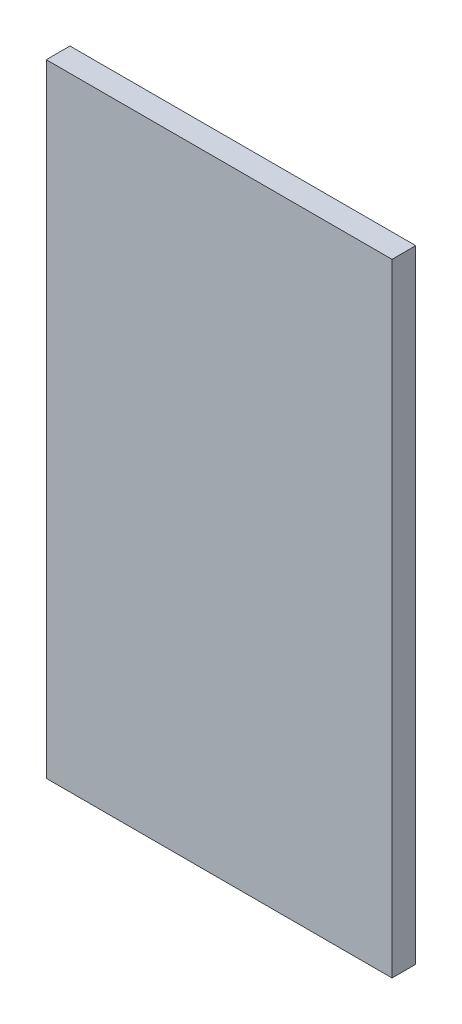
ISO-10303-21;
HEADER;
FILE_DESCRIPTION(('STEP AP214'),'2;1');
FILE_NAME('part.step','',(''),(''),'','','');
FILE_SCHEMA(('AUTOMOTIVE_DESIGN { 1 0 10303 214 1 1 1 1 }'));
ENDSEC;
DATA;
#1=APPLICATION_CONTEXT('core data for automotive mechanical design processes');
#2=APPLICATION_PROTOCOL_DEFINITION('international standard','automotive_design',2000,#1);
#3=PRODUCT_CONTEXT('',#1,'mechanical');
#4=PRODUCT('Part','Part','',(#3));
#5=PRODUCT_RELATED_PRODUCT_CATEGORY('part','',(#4));
#6=PRODUCT_DEFINITION_FORMATION('','',#4);
#7=PRODUCT_DEFINITION_CONTEXT('part definition',#1,'design');
#8=PRODUCT_DEFINITION('design','',#6,#7);
#9=PRODUCT_DEFINITION_SHAPE('','',#8);
#10=(LENGTH_UNIT() NAMED_UNIT(*) SI_UNIT(.MILLI.,.METRE.));
#11=(NAMED_UNIT(*) PLANE_ANGLE_UNIT() SI_UNIT($,.RADIAN.));
#12=(NAMED_UNIT(*) SI_UNIT($,.STERADIAN.) SOLID_ANGLE_UNIT());
#13=UNCERTAINTY_MEASURE_WITH_UNIT(LENGTH_MEASURE(1.E-05),#10,'distance_accuracy_value','');
#14=(GEOMETRIC_REPRESENTATION_CONTEXT(3) GLOBAL_UNCERTAINTY_ASSIGNED_CONTEXT((#13)) GLOBAL_UNIT_ASSIGNED_CONTEXT((#10,
#11,#12)) REPRESENTATION_CONTEXT('',''));
#15=CARTESIAN_POINT('',(0.,0.,0.));
#16=DIRECTION('',(0.,0.,1.));
#17=DIRECTION('',(1.,0.,0.));
#18=AXIS2_PLACEMENT_3D('',#15,#16,#17);
#19=CARTESIAN_POINT('',(10.60008,0.7,0.));
#20=DIRECTION('',(0.,0.,-1.));
#21=DIRECTION('',(-1.,0.,0.));
#22=AXIS2_PLACEMENT_3D('',#19,#20,#21);
#23=PLANE('',#22);
#24=DIRECTION('',(1.,0.,0.));
#25=VECTOR('',#24,1.);
#26=CARTESIAN_POINT('',(10.35008,1.15,0.));
#27=LINE('',#26,#25);
#28=CARTESIAN_POINT('',(10.35008,1.15,0.));
#29=VERTEX_POINT('',#28);
#30=CARTESIAN_POINT('',(10.85008,1.15,0.));
#31=VERTEX_POINT('',#30);
#32=EDGE_CURVE('E55',#29,#31,#27,.T.);
#33=ORIENTED_EDGE('',*,*,#32,.T.);
#34=DIRECTION('',(0.,1.,0.));
#35=VECTOR('',#34,1.);
#36=CARTESIAN_POINT('',(10.85008,1.15,0.));
#37=LINE('',#36,#35);
#38=CARTESIAN_POINT('',(10.85008,0.25,0.));
#39=VERTEX_POINT('',#38);
#40=EDGE_CURVE('E57',#31,#39,#37,.F.);
#41=ORIENTED_EDGE('',*,*,#40,.T.);
#42=DIRECTION('',(1.,0.,0.));
#43=VECTOR('',#42,1.);
#44=CARTESIAN_POINT('',(10.85008,0.25,0.));
#45=LINE('',#44,#43);
#46=CARTESIAN_POINT('',(10.35008,0.25,0.));
#47=VERTEX_POINT('',#46);
#48=EDGE_CURVE('E20',#39,#47,#45,.F.);
#49=ORIENTED_EDGE('',*,*,#48,.T.);
#50=DIRECTION('',(0.,1.,0.));
#51=VECTOR('',#50,1.);
#52=CARTESIAN_POINT('',(10.35008,0.25,0.));
#53=LINE('',#52,#51);
#54=EDGE_CURVE('E80',#47,#29,#53,.T.);
#55=ORIENTED_EDGE('',*,*,#54,.T.);
#56=EDGE_LOOP('',(#33,#41,#49,#55));
#57=FACE_BOUND('',#56,.T.);
#58=ADVANCED_FACE('F17',(#57),#23,.T.);
#59=CARTESIAN_POINT('',(10.85008,0.25,0.));
#60=DIRECTION('',(0.,1.,0.));
#61=DIRECTION('',(0.,0.,1.));
#62=AXIS2_PLACEMENT_3D('',#59,#60,#61);
#63=PLANE('',#62);
#64=DIRECTION('',(0.,0.,-1.));
#65=VECTOR('',#64,1.);
#66=CARTESIAN_POINT('',(10.35008,0.25,0.));
#67=LINE('',#66,#65);
#68=CARTESIAN_POINT('',(10.35008,0.25,0.03429));
#69=VERTEX_POINT('',#68);
#70=EDGE_CURVE('E68',#69,#47,#67,.T.);
#71=ORIENTED_EDGE('',*,*,#70,.T.);
#72=ORIENTED_EDGE('',*,*,#48,.F.);
#73=DIRECTION('',(0.,0.,1.));
#74=VECTOR('',#73,1.);
#75=CARTESIAN_POINT('',(10.85008,0.25,0.));
#76=LINE('',#75,#74);
#77=CARTESIAN_POINT('',(10.85008,0.25,0.03429));
#78=VERTEX_POINT('',#77);
#79=EDGE_CURVE('E63',#39,#78,#76,.T.);
#80=ORIENTED_EDGE('',*,*,#79,.T.);
#81=DIRECTION('',(1.,0.,0.));
#82=VECTOR('',#81,1.);
#83=CARTESIAN_POINT('',(10.60008,0.25,0.03429));
#84=LINE('',#83,#82);
#85=EDGE_CURVE('E83',#69,#78,#84,.T.);
#86=ORIENTED_EDGE('',*,*,#85,.F.);
#87=EDGE_LOOP('',(#71,#72,#80,#86));
#88=FACE_BOUND('',#87,.T.);
#89=ADVANCED_FACE('F65',(#88),#63,.F.);
#90=CARTESIAN_POINT('',(10.85008,1.15,0.));
#91=DIRECTION('',(-1.,0.,0.));
#92=DIRECTION('',(0.,0.,1.));
#93=AXIS2_PLACEMENT_3D('',#90,#91,#92);
#94=PLANE('',#93);
#95=ORIENTED_EDGE('',*,*,#79,.F.);
#96=ORIENTED_EDGE('',*,*,#40,.F.);
#97=DIRECTION('',(0.,0.,-1.));
#98=VECTOR('',#97,1.);
#99=CARTESIAN_POINT('',(10.85008,1.15,0.));
#100=LINE('',#99,#98);
#101=CARTESIAN_POINT('',(10.85008,1.15,0.03429));
#102=VERTEX_POINT('',#101);
#103=EDGE_CURVE('E75',#31,#102,#100,.F.);
#104=ORIENTED_EDGE('',*,*,#103,.T.);
#105=DIRECTION('',(0.,1.,0.));
#106=VECTOR('',#105,1.);
#107=CARTESIAN_POINT('',(10.85008,0.7,0.03429));
#108=LINE('',#107,#106);
#109=EDGE_CURVE('E72',#78,#102,#108,.T.);
#110=ORIENTED_EDGE('',*,*,#109,.F.);
#111=EDGE_LOOP('',(#95,#96,#104,#110));
#112=FACE_BOUND('',#111,.T.);
#113=ADVANCED_FACE('F70',(#112),#94,.F.);
#114=CARTESIAN_POINT('',(10.35008,1.15,0.));
#115=DIRECTION('',(0.,-1.,0.));
#116=DIRECTION('',(0.,0.,-1.));
#117=AXIS2_PLACEMENT_3D('',#114,#115,#116);
#118=PLANE('',#117);
#119=ORIENTED_EDGE('',*,*,#103,.F.);
#120=ORIENTED_EDGE('',*,*,#32,.F.);
#121=DIRECTION('',(0.,0.,-1.));
#122=VECTOR('',#121,1.);
#123=CARTESIAN_POINT('',(10.35008,1.15,0.));
#124=LINE('',#123,#122);
#125=CARTESIAN_POINT('',(10.35008,1.15,0.03429));
#126=VERTEX_POINT('',#125);
#127=EDGE_CURVE('E35',#29,#126,#124,.F.);
#128=ORIENTED_EDGE('',*,*,#127,.T.);
#129=DIRECTION('',(1.,0.,0.));
#130=VECTOR('',#129,1.);
#131=CARTESIAN_POINT('',(10.60008,1.15,0.03429));
#132=LINE('',#131,#130);
#133=EDGE_CURVE('E26',#102,#126,#132,.F.);
#134=ORIENTED_EDGE('',*,*,#133,.F.);
#135=EDGE_LOOP('',(#119,#120,#128,#134));
#136=FACE_BOUND('',#135,.T.);
#137=ADVANCED_FACE('F89',(#136),#118,.F.);
#138=CARTESIAN_POINT('',(10.35008,0.25,0.));
#139=DIRECTION('',(1.,0.,0.));
#140=DIRECTION('',(0.,0.,-1.));
#141=AXIS2_PLACEMENT_3D('',#138,#139,#140);
#142=PLANE('',#141);
#143=ORIENTED_EDGE('',*,*,#127,.F.);
#144=ORIENTED_EDGE('',*,*,#54,.F.);
#145=ORIENTED_EDGE('',*,*,#70,.F.);
#146=DIRECTION('',(0.,1.,0.));
#147=VECTOR('',#146,1.);
#148=CARTESIAN_POINT('',(10.35008,0.7,0.03429));
#149=LINE('',#148,#147);
#150=EDGE_CURVE('E11',#126,#69,#149,.F.);
#151=ORIENTED_EDGE('',*,*,#150,.F.);
#152=EDGE_LOOP('',(#143,#144,#145,#151));
#153=FACE_BOUND('',#152,.T.);
#154=ADVANCED_FACE('F91',(#153),#142,.F.);
#155=CARTESIAN_POINT('',(10.60008,0.7,0.03429));
#156=DIRECTION('',(0.,0.,1.));
#157=DIRECTION('',(1.,0.,0.));
#158=AXIS2_PLACEMENT_3D('',#155,#156,#157);
#159=PLANE('',#158);
#160=ORIENTED_EDGE('',*,*,#133,.T.);
#161=ORIENTED_EDGE('',*,*,#150,.T.);
#162=ORIENTED_EDGE('',*,*,#85,.T.);
#163=ORIENTED_EDGE('',*,*,#109,.T.);
#164=EDGE_LOOP('',(#160,#161,#162,#163));
#165=FACE_BOUND('',#164,.T.);
#166=ADVANCED_FACE('F88',(#165),#159,.T.);
#167=CLOSED_SHELL('',(#58,#89,#113,#137,#154,#166));
#168=MANIFOLD_SOLID_BREP('B1',#167);
#169=ADVANCED_BREP_SHAPE_REPRESENTATION('',(#18,#168),#14);
#170=SHAPE_DEFINITION_REPRESENTATION(#9,#169);
ENDSEC;
END-ISO-10303-21;
